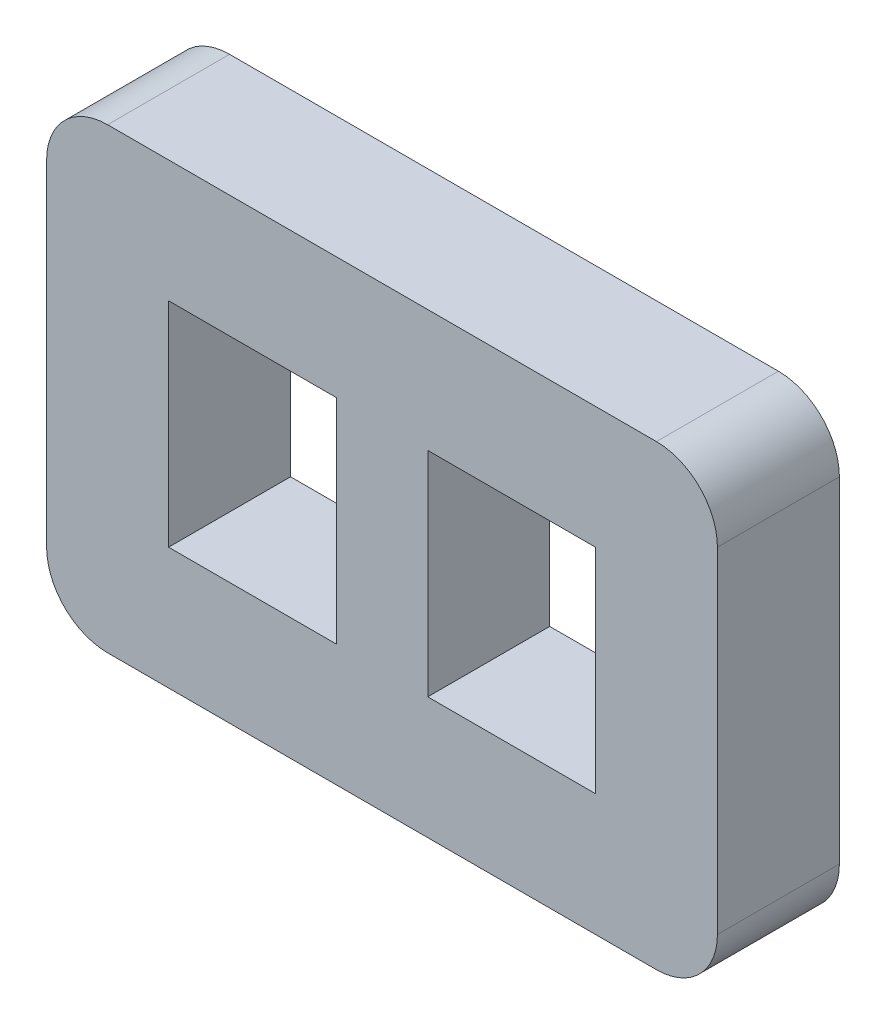
ISO-10303-21;
HEADER;
FILE_DESCRIPTION(('STEP AP214'),'2;1');
FILE_NAME('part.step','',(''),(''),'','','');
FILE_SCHEMA(('AUTOMOTIVE_DESIGN { 1 0 10303 214 1 1 1 1 }'));
ENDSEC;
DATA;
#1=APPLICATION_CONTEXT('core data for automotive mechanical design processes');
#2=APPLICATION_PROTOCOL_DEFINITION('international standard','automotive_design',2000,#1);
#3=PRODUCT_CONTEXT('',#1,'mechanical');
#4=PRODUCT('Part','Part','',(#3));
#5=PRODUCT_RELATED_PRODUCT_CATEGORY('part','',(#4));
#6=PRODUCT_DEFINITION_FORMATION('','',#4);
#7=PRODUCT_DEFINITION_CONTEXT('part definition',#1,'design');
#8=PRODUCT_DEFINITION('design','',#6,#7);
#9=PRODUCT_DEFINITION_SHAPE('','',#8);
#10=(LENGTH_UNIT() NAMED_UNIT(*) SI_UNIT(.MILLI.,.METRE.));
#11=(NAMED_UNIT(*) PLANE_ANGLE_UNIT() SI_UNIT($,.RADIAN.));
#12=(NAMED_UNIT(*) SI_UNIT($,.STERADIAN.) SOLID_ANGLE_UNIT());
#13=UNCERTAINTY_MEASURE_WITH_UNIT(LENGTH_MEASURE(1.E-05),#10,'distance_accuracy_value','');
#14=(GEOMETRIC_REPRESENTATION_CONTEXT(3) GLOBAL_UNCERTAINTY_ASSIGNED_CONTEXT((#13)) GLOBAL_UNIT_ASSIGNED_CONTEXT((#10,
#11,#12)) REPRESENTATION_CONTEXT('',''));
#15=CARTESIAN_POINT('',(0.,0.,0.));
#16=DIRECTION('',(0.,0.,1.));
#17=DIRECTION('',(1.,0.,0.));
#18=AXIS2_PLACEMENT_3D('',#15,#16,#17);
#19=CARTESIAN_POINT('',(-4.5,15.,2.));
#20=DIRECTION('',(0.,0.,1.));
#21=DIRECTION('',(1.,0.,0.));
#22=AXIS2_PLACEMENT_3D('',#19,#20,#21);
#23=PLANE('',#22);
#24=DIRECTION('',(0.,-1.,0.));
#25=VECTOR('',#24,1.);
#26=CARTESIAN_POINT('',(-3.5,16.,2.));
#27=LINE('',#26,#25);
#28=CARTESIAN_POINT('',(-3.5,19.5,2.));
#29=VERTEX_POINT('',#28);
#30=CARTESIAN_POINT('',(-3.5,16.,2.));
#31=VERTEX_POINT('',#30);
#32=EDGE_CURVE('E184',#29,#31,#27,.T.);
#33=ORIENTED_EDGE('',*,*,#32,.F.);
#34=DIRECTION('',(-1.,0.,0.));
#35=VECTOR('',#34,1.);
#36=CARTESIAN_POINT('',(-0.75,19.5,2.));
#37=LINE('',#36,#35);
#38=CARTESIAN_POINT('',(-0.75,19.5,2.));
#39=VERTEX_POINT('',#38);
#40=EDGE_CURVE('E182',#39,#29,#37,.T.);
#41=ORIENTED_EDGE('',*,*,#40,.F.);
#42=DIRECTION('',(0.,1.,0.));
#43=VECTOR('',#42,1.);
#44=CARTESIAN_POINT('',(-0.75,16.,2.));
#45=LINE('',#44,#43);
#46=CARTESIAN_POINT('',(-0.75,16.,2.));
#47=VERTEX_POINT('',#46);
#48=EDGE_CURVE('E190',#47,#39,#45,.T.);
#49=ORIENTED_EDGE('',*,*,#48,.F.);
#50=DIRECTION('',(1.,0.,0.));
#51=VECTOR('',#50,1.);
#52=CARTESIAN_POINT('',(-0.75,16.,2.));
#53=LINE('',#52,#51);
#54=EDGE_CURVE('E187',#31,#47,#53,.T.);
#55=ORIENTED_EDGE('',*,*,#54,.F.);
#56=EDGE_LOOP('',(#33,#41,#49,#55));
#57=FACE_BOUND('',#56,.T.);
#58=CARTESIAN_POINT('',(-4.5,15.,2.));
#59=DIRECTION('',(0.,0.,1.));
#60=DIRECTION('',(1.,0.,0.));
#61=AXIS2_PLACEMENT_3D('',#58,#59,#60);
#62=CIRCLE('',#61,1.);
#63=CARTESIAN_POINT('',(-5.5,15.,2.));
#64=VERTEX_POINT('',#63);
#65=CARTESIAN_POINT('',(-4.49999999999999,14.,2.));
#66=VERTEX_POINT('',#65);
#67=EDGE_CURVE('E213',#64,#66,#62,.T.);
#68=ORIENTED_EDGE('',*,*,#67,.T.);
#69=DIRECTION('',(1.,0.,0.));
#70=VECTOR('',#69,1.);
#71=CARTESIAN_POINT('',(4.49999999999999,14.,2.));
#72=LINE('',#71,#70);
#73=CARTESIAN_POINT('',(4.49999999999999,14.,2.));
#74=VERTEX_POINT('',#73);
#75=EDGE_CURVE('E216',#66,#74,#72,.T.);
#76=ORIENTED_EDGE('',*,*,#75,.T.);
#77=CARTESIAN_POINT('',(4.5,15.,2.));
#78=DIRECTION('',(0.,0.,1.));
#79=DIRECTION('',(1.,0.,0.));
#80=AXIS2_PLACEMENT_3D('',#77,#78,#79);
#81=CIRCLE('',#80,1.);
#82=CARTESIAN_POINT('',(5.5,15.,2.));
#83=VERTEX_POINT('',#82);
#84=EDGE_CURVE('E219',#74,#83,#81,.T.);
#85=ORIENTED_EDGE('',*,*,#84,.T.);
#86=DIRECTION('',(0.,1.,0.));
#87=VECTOR('',#86,1.);
#88=CARTESIAN_POINT('',(5.5,15.,2.));
#89=LINE('',#88,#87);
#90=CARTESIAN_POINT('',(5.5,20.5,2.));
#91=VERTEX_POINT('',#90);
#92=EDGE_CURVE('E221',#83,#91,#89,.T.);
#93=ORIENTED_EDGE('',*,*,#92,.T.);
#94=CARTESIAN_POINT('',(4.5,20.5,2.));
#95=DIRECTION('',(0.,0.,1.));
#96=DIRECTION('',(1.,0.,0.));
#97=AXIS2_PLACEMENT_3D('',#94,#95,#96);
#98=CIRCLE('',#97,1.);
#99=CARTESIAN_POINT('',(4.49999999999999,21.5,2.));
#100=VERTEX_POINT('',#99);
#101=EDGE_CURVE('E223',#91,#100,#98,.T.);
#102=ORIENTED_EDGE('',*,*,#101,.T.);
#103=DIRECTION('',(-1.,0.,0.));
#104=VECTOR('',#103,1.);
#105=CARTESIAN_POINT('',(4.49999999999999,21.5,2.));
#106=LINE('',#105,#104);
#107=CARTESIAN_POINT('',(-4.49999999999999,21.5,2.));
#108=VERTEX_POINT('',#107);
#109=EDGE_CURVE('E225',#100,#108,#106,.T.);
#110=ORIENTED_EDGE('',*,*,#109,.T.);
#111=CARTESIAN_POINT('',(-4.5,20.5,2.));
#112=DIRECTION('',(0.,0.,1.));
#113=DIRECTION('',(-1.,0.,0.));
#114=AXIS2_PLACEMENT_3D('',#111,#112,#113);
#115=CIRCLE('',#114,1.);
#116=CARTESIAN_POINT('',(-5.5,20.5,2.));
#117=VERTEX_POINT('',#116);
#118=EDGE_CURVE('E227',#108,#117,#115,.T.);
#119=ORIENTED_EDGE('',*,*,#118,.T.);
#120=DIRECTION('',(0.,-1.,0.));
#121=VECTOR('',#120,1.);
#122=CARTESIAN_POINT('',(-5.5,15.,2.));
#123=LINE('',#122,#121);
#124=EDGE_CURVE('E229',#117,#64,#123,.T.);
#125=ORIENTED_EDGE('',*,*,#124,.T.);
#126=EDGE_LOOP('',(#68,#76,#85,#93,#102,#110,#119,#125));
#127=FACE_BOUND('',#126,.T.);
#128=DIRECTION('',(-1.,0.,0.));
#129=VECTOR('',#128,1.);
#130=CARTESIAN_POINT('',(3.5,19.5,2.));
#131=LINE('',#130,#129);
#132=CARTESIAN_POINT('',(3.5,19.5,2.));
#133=VERTEX_POINT('',#132);
#134=CARTESIAN_POINT('',(0.75,19.5,2.));
#135=VERTEX_POINT('',#134);
#136=EDGE_CURVE('E154',#133,#135,#131,.T.);
#137=ORIENTED_EDGE('',*,*,#136,.F.);
#138=DIRECTION('',(0.,1.,0.));
#139=VECTOR('',#138,1.);
#140=CARTESIAN_POINT('',(3.5,16.,2.));
#141=LINE('',#140,#139);
#142=CARTESIAN_POINT('',(3.5,16.,2.));
#143=VERTEX_POINT('',#142);
#144=EDGE_CURVE('E146',#143,#133,#141,.T.);
#145=ORIENTED_EDGE('',*,*,#144,.F.);
#146=DIRECTION('',(1.,0.,0.));
#147=VECTOR('',#146,1.);
#148=CARTESIAN_POINT('',(3.5,16.,2.));
#149=LINE('',#148,#147);
#150=CARTESIAN_POINT('',(0.75,16.,2.));
#151=VERTEX_POINT('',#150);
#152=EDGE_CURVE('E168',#151,#143,#149,.T.);
#153=ORIENTED_EDGE('',*,*,#152,.F.);
#154=DIRECTION('',(0.,-1.,0.));
#155=VECTOR('',#154,1.);
#156=CARTESIAN_POINT('',(0.75,16.,2.));
#157=LINE('',#156,#155);
#158=EDGE_CURVE('E166',#135,#151,#157,.T.);
#159=ORIENTED_EDGE('',*,*,#158,.F.);
#160=EDGE_LOOP('',(#137,#145,#153,#159));
#161=FACE_BOUND('',#160,.T.);
#162=ADVANCED_FACE('F33',(#57,#127,#161),#23,.T.);
#163=CARTESIAN_POINT('',(-4.5,15.,0.));
#164=DIRECTION('',(0.,0.,1.));
#165=DIRECTION('',(1.,0.,0.));
#166=AXIS2_PLACEMENT_3D('',#163,#164,#165);
#167=PLANE('',#166);
#168=DIRECTION('',(-1.,0.,0.));
#169=VECTOR('',#168,1.);
#170=CARTESIAN_POINT('',(-0.75,19.5,0.));
#171=LINE('',#170,#169);
#172=CARTESIAN_POINT('',(-0.75,19.5,0.));
#173=VERTEX_POINT('',#172);
#174=CARTESIAN_POINT('',(-3.5,19.5,0.));
#175=VERTEX_POINT('',#174);
#176=EDGE_CURVE('E162',#173,#175,#171,.T.);
#177=ORIENTED_EDGE('',*,*,#176,.T.);
#178=DIRECTION('',(0.,-1.,0.));
#179=VECTOR('',#178,1.);
#180=CARTESIAN_POINT('',(-3.5,16.,0.));
#181=LINE('',#180,#179);
#182=CARTESIAN_POINT('',(-3.5,16.,0.));
#183=VERTEX_POINT('',#182);
#184=EDGE_CURVE('E195',#175,#183,#181,.T.);
#185=ORIENTED_EDGE('',*,*,#184,.T.);
#186=DIRECTION('',(1.,0.,0.));
#187=VECTOR('',#186,1.);
#188=CARTESIAN_POINT('',(-0.75,16.,0.));
#189=LINE('',#188,#187);
#190=CARTESIAN_POINT('',(-0.75,16.,0.));
#191=VERTEX_POINT('',#190);
#192=EDGE_CURVE('E198',#183,#191,#189,.T.);
#193=ORIENTED_EDGE('',*,*,#192,.T.);
#194=DIRECTION('',(0.,1.,0.));
#195=VECTOR('',#194,1.);
#196=CARTESIAN_POINT('',(-0.75,16.,0.));
#197=LINE('',#196,#195);
#198=EDGE_CURVE('E185',#191,#173,#197,.T.);
#199=ORIENTED_EDGE('',*,*,#198,.T.);
#200=EDGE_LOOP('',(#177,#185,#193,#199));
#201=FACE_BOUND('',#200,.T.);
#202=CARTESIAN_POINT('',(-4.5,15.,0.));
#203=DIRECTION('',(0.,0.,1.));
#204=DIRECTION('',(1.,0.,0.));
#205=AXIS2_PLACEMENT_3D('',#202,#203,#204);
#206=CIRCLE('',#205,1.);
#207=CARTESIAN_POINT('',(-5.5,15.,0.));
#208=VERTEX_POINT('',#207);
#209=CARTESIAN_POINT('',(-4.49999999999999,14.,0.));
#210=VERTEX_POINT('',#209);
#211=EDGE_CURVE('E212',#208,#210,#206,.T.);
#212=ORIENTED_EDGE('',*,*,#211,.F.);
#213=DIRECTION('',(0.,-1.,0.));
#214=VECTOR('',#213,1.);
#215=CARTESIAN_POINT('',(-5.5,15.,0.));
#216=LINE('',#215,#214);
#217=CARTESIAN_POINT('',(-5.5,20.5,0.));
#218=VERTEX_POINT('',#217);
#219=EDGE_CURVE('E217',#218,#208,#216,.T.);
#220=ORIENTED_EDGE('',*,*,#219,.F.);
#221=CARTESIAN_POINT('',(-4.5,20.5,0.));
#222=DIRECTION('',(0.,0.,1.));
#223=DIRECTION('',(-1.,0.,0.));
#224=AXIS2_PLACEMENT_3D('',#221,#222,#223);
#225=CIRCLE('',#224,1.);
#226=CARTESIAN_POINT('',(-4.49999999999999,21.5,0.));
#227=VERTEX_POINT('',#226);
#228=EDGE_CURVE('E244',#227,#218,#225,.T.);
#229=ORIENTED_EDGE('',*,*,#228,.F.);
#230=DIRECTION('',(-1.,0.,0.));
#231=VECTOR('',#230,1.);
#232=CARTESIAN_POINT('',(4.49999999999999,21.5,0.));
#233=LINE('',#232,#231);
#234=CARTESIAN_POINT('',(4.49999999999999,21.5,0.));
#235=VERTEX_POINT('',#234);
#236=EDGE_CURVE('E242',#235,#227,#233,.T.);
#237=ORIENTED_EDGE('',*,*,#236,.F.);
#238=CARTESIAN_POINT('',(4.5,20.5,0.));
#239=DIRECTION('',(0.,0.,1.));
#240=DIRECTION('',(1.,0.,0.));
#241=AXIS2_PLACEMENT_3D('',#238,#239,#240);
#242=CIRCLE('',#241,1.);
#243=CARTESIAN_POINT('',(5.5,20.5,0.));
#244=VERTEX_POINT('',#243);
#245=EDGE_CURVE('E240',#244,#235,#242,.T.);
#246=ORIENTED_EDGE('',*,*,#245,.F.);
#247=DIRECTION('',(0.,1.,0.));
#248=VECTOR('',#247,1.);
#249=CARTESIAN_POINT('',(5.5,15.,0.));
#250=LINE('',#249,#248);
#251=CARTESIAN_POINT('',(5.5,15.,0.));
#252=VERTEX_POINT('',#251);
#253=EDGE_CURVE('E238',#252,#244,#250,.T.);
#254=ORIENTED_EDGE('',*,*,#253,.F.);
#255=CARTESIAN_POINT('',(4.5,15.,0.));
#256=DIRECTION('',(0.,0.,1.));
#257=DIRECTION('',(1.,0.,0.));
#258=AXIS2_PLACEMENT_3D('',#255,#256,#257);
#259=CIRCLE('',#258,1.);
#260=CARTESIAN_POINT('',(4.49999999999999,14.,0.));
#261=VERTEX_POINT('',#260);
#262=EDGE_CURVE('E236',#261,#252,#259,.T.);
#263=ORIENTED_EDGE('',*,*,#262,.F.);
#264=DIRECTION('',(1.,0.,0.));
#265=VECTOR('',#264,1.);
#266=CARTESIAN_POINT('',(4.49999999999999,14.,0.));
#267=LINE('',#266,#265);
#268=EDGE_CURVE('E234',#210,#261,#267,.T.);
#269=ORIENTED_EDGE('',*,*,#268,.F.);
#270=EDGE_LOOP('',(#212,#220,#229,#237,#246,#254,#263,#269));
#271=FACE_BOUND('',#270,.T.);
#272=DIRECTION('',(0.,1.,0.));
#273=VECTOR('',#272,1.);
#274=CARTESIAN_POINT('',(3.5,16.,0.));
#275=LINE('',#274,#273);
#276=CARTESIAN_POINT('',(3.5,16.,0.));
#277=VERTEX_POINT('',#276);
#278=CARTESIAN_POINT('',(3.5,19.5,0.));
#279=VERTEX_POINT('',#278);
#280=EDGE_CURVE('E56',#277,#279,#275,.T.);
#281=ORIENTED_EDGE('',*,*,#280,.T.);
#282=DIRECTION('',(-1.,0.,0.));
#283=VECTOR('',#282,1.);
#284=CARTESIAN_POINT('',(3.5,19.5,0.));
#285=LINE('',#284,#283);
#286=CARTESIAN_POINT('',(0.75,19.5,0.));
#287=VERTEX_POINT('',#286);
#288=EDGE_CURVE('E161',#279,#287,#285,.T.);
#289=ORIENTED_EDGE('',*,*,#288,.T.);
#290=DIRECTION('',(0.,-1.,0.));
#291=VECTOR('',#290,1.);
#292=CARTESIAN_POINT('',(0.75,16.,0.));
#293=LINE('',#292,#291);
#294=CARTESIAN_POINT('',(0.75,16.,0.));
#295=VERTEX_POINT('',#294);
#296=EDGE_CURVE('E174',#287,#295,#293,.T.);
#297=ORIENTED_EDGE('',*,*,#296,.T.);
#298=DIRECTION('',(1.,0.,0.));
#299=VECTOR('',#298,1.);
#300=CARTESIAN_POINT('',(3.5,16.,0.));
#301=LINE('',#300,#299);
#302=EDGE_CURVE('E155',#295,#277,#301,.T.);
#303=ORIENTED_EDGE('',*,*,#302,.T.);
#304=EDGE_LOOP('',(#281,#289,#297,#303));
#305=FACE_BOUND('',#304,.T.);
#306=ADVANCED_FACE('F274',(#201,#271,#305),#167,.F.);
#307=CARTESIAN_POINT('',(-4.5,15.,2.));
#308=DIRECTION('',(0.,0.,-1.));
#309=DIRECTION('',(-1.,0.,0.));
#310=AXIS2_PLACEMENT_3D('',#307,#308,#309);
#311=CYLINDRICAL_SURFACE('',#310,1.);
#312=ORIENTED_EDGE('',*,*,#211,.T.);
#313=DIRECTION('',(0.,0.,-1.));
#314=VECTOR('',#313,1.);
#315=CARTESIAN_POINT('',(-4.49999999999999,14.,2.));
#316=LINE('',#315,#314);
#317=EDGE_CURVE('E11',#66,#210,#316,.T.);
#318=ORIENTED_EDGE('',*,*,#317,.F.);
#319=ORIENTED_EDGE('',*,*,#67,.F.);
#320=DIRECTION('',(0.,0.,-1.));
#321=VECTOR('',#320,1.);
#322=CARTESIAN_POINT('',(-5.5,15.,2.));
#323=LINE('',#322,#321);
#324=EDGE_CURVE('E231',#64,#208,#323,.T.);
#325=ORIENTED_EDGE('',*,*,#324,.T.);
#326=EDGE_LOOP('',(#312,#318,#319,#325));
#327=FACE_BOUND('',#326,.T.);
#328=ADVANCED_FACE('F35',(#327),#311,.T.);
#329=CARTESIAN_POINT('',(4.49999999999999,14.,2.));
#330=DIRECTION('',(0.,1.,0.));
#331=DIRECTION('',(-1.,0.,0.));
#332=AXIS2_PLACEMENT_3D('',#329,#330,#331);
#333=PLANE('',#332);
#334=ORIENTED_EDGE('',*,*,#268,.T.);
#335=DIRECTION('',(0.,0.,-1.));
#336=VECTOR('',#335,1.);
#337=CARTESIAN_POINT('',(4.49999999999999,14.,2.));
#338=LINE('',#337,#336);
#339=EDGE_CURVE('E41',#74,#261,#338,.T.);
#340=ORIENTED_EDGE('',*,*,#339,.F.);
#341=ORIENTED_EDGE('',*,*,#75,.F.);
#342=ORIENTED_EDGE('',*,*,#317,.T.);
#343=EDGE_LOOP('',(#334,#340,#341,#342));
#344=FACE_BOUND('',#343,.T.);
#345=ADVANCED_FACE('F291',(#344),#333,.F.);
#346=CARTESIAN_POINT('',(4.5,15.,2.));
#347=DIRECTION('',(0.,0.,-1.));
#348=DIRECTION('',(-1.,0.,0.));
#349=AXIS2_PLACEMENT_3D('',#346,#347,#348);
#350=CYLINDRICAL_SURFACE('',#349,1.);
#351=ORIENTED_EDGE('',*,*,#262,.T.);
#352=DIRECTION('',(0.,0.,-1.));
#353=VECTOR('',#352,1.);
#354=CARTESIAN_POINT('',(5.5,15.,2.));
#355=LINE('',#354,#353);
#356=EDGE_CURVE('E261',#83,#252,#355,.T.);
#357=ORIENTED_EDGE('',*,*,#356,.F.);
#358=ORIENTED_EDGE('',*,*,#84,.F.);
#359=ORIENTED_EDGE('',*,*,#339,.T.);
#360=EDGE_LOOP('',(#351,#357,#358,#359));
#361=FACE_BOUND('',#360,.T.);
#362=ADVANCED_FACE('F268',(#361),#350,.T.);
#363=CARTESIAN_POINT('',(5.5,15.,2.));
#364=DIRECTION('',(-1.,0.,0.));
#365=DIRECTION('',(0.,0.,1.));
#366=AXIS2_PLACEMENT_3D('',#363,#364,#365);
#367=PLANE('',#366);
#368=ORIENTED_EDGE('',*,*,#253,.T.);
#369=DIRECTION('',(0.,0.,-1.));
#370=VECTOR('',#369,1.);
#371=CARTESIAN_POINT('',(5.5,20.5,2.));
#372=LINE('',#371,#370);
#373=EDGE_CURVE('E258',#91,#244,#372,.T.);
#374=ORIENTED_EDGE('',*,*,#373,.F.);
#375=ORIENTED_EDGE('',*,*,#92,.F.);
#376=ORIENTED_EDGE('',*,*,#356,.T.);
#377=EDGE_LOOP('',(#368,#374,#375,#376));
#378=FACE_BOUND('',#377,.T.);
#379=ADVANCED_FACE('F280',(#378),#367,.F.);
#380=CARTESIAN_POINT('',(4.5,20.5,2.));
#381=DIRECTION('',(0.,0.,-1.));
#382=DIRECTION('',(-1.,0.,0.));
#383=AXIS2_PLACEMENT_3D('',#380,#381,#382);
#384=CYLINDRICAL_SURFACE('',#383,1.);
#385=ORIENTED_EDGE('',*,*,#245,.T.);
#386=DIRECTION('',(0.,0.,-1.));
#387=VECTOR('',#386,1.);
#388=CARTESIAN_POINT('',(4.49999999999999,21.5,2.));
#389=LINE('',#388,#387);
#390=EDGE_CURVE('E255',#100,#235,#389,.T.);
#391=ORIENTED_EDGE('',*,*,#390,.F.);
#392=ORIENTED_EDGE('',*,*,#101,.F.);
#393=ORIENTED_EDGE('',*,*,#373,.T.);
#394=EDGE_LOOP('',(#385,#391,#392,#393));
#395=FACE_BOUND('',#394,.T.);
#396=ADVANCED_FACE('F284',(#395),#384,.T.);
#397=CARTESIAN_POINT('',(4.49999999999999,21.5,2.));
#398=DIRECTION('',(0.,-1.,0.));
#399=DIRECTION('',(0.,0.,-1.));
#400=AXIS2_PLACEMENT_3D('',#397,#398,#399);
#401=PLANE('',#400);
#402=ORIENTED_EDGE('',*,*,#236,.T.);
#403=DIRECTION('',(0.,0.,-1.));
#404=VECTOR('',#403,1.);
#405=CARTESIAN_POINT('',(-4.49999999999999,21.5,2.));
#406=LINE('',#405,#404);
#407=EDGE_CURVE('E252',#108,#227,#406,.T.);
#408=ORIENTED_EDGE('',*,*,#407,.F.);
#409=ORIENTED_EDGE('',*,*,#109,.F.);
#410=ORIENTED_EDGE('',*,*,#390,.T.);
#411=EDGE_LOOP('',(#402,#408,#409,#410));
#412=FACE_BOUND('',#411,.T.);
#413=ADVANCED_FACE('F304',(#412),#401,.F.);
#414=CARTESIAN_POINT('',(-4.5,20.5,2.));
#415=DIRECTION('',(0.,0.,-1.));
#416=DIRECTION('',(-1.,0.,0.));
#417=AXIS2_PLACEMENT_3D('',#414,#415,#416);
#418=CYLINDRICAL_SURFACE('',#417,1.);
#419=ORIENTED_EDGE('',*,*,#228,.T.);
#420=DIRECTION('',(0.,0.,-1.));
#421=VECTOR('',#420,1.);
#422=CARTESIAN_POINT('',(-5.5,20.5,2.));
#423=LINE('',#422,#421);
#424=EDGE_CURVE('E249',#117,#218,#423,.T.);
#425=ORIENTED_EDGE('',*,*,#424,.F.);
#426=ORIENTED_EDGE('',*,*,#118,.F.);
#427=ORIENTED_EDGE('',*,*,#407,.T.);
#428=EDGE_LOOP('',(#419,#425,#426,#427));
#429=FACE_BOUND('',#428,.T.);
#430=ADVANCED_FACE('F302',(#429),#418,.T.);
#431=CARTESIAN_POINT('',(-5.5,15.,2.));
#432=DIRECTION('',(1.,0.,0.));
#433=DIRECTION('',(0.,1.,0.));
#434=AXIS2_PLACEMENT_3D('',#431,#432,#433);
#435=PLANE('',#434);
#436=ORIENTED_EDGE('',*,*,#219,.T.);
#437=ORIENTED_EDGE('',*,*,#324,.F.);
#438=ORIENTED_EDGE('',*,*,#124,.F.);
#439=ORIENTED_EDGE('',*,*,#424,.T.);
#440=EDGE_LOOP('',(#436,#437,#438,#439));
#441=FACE_BOUND('',#440,.T.);
#442=ADVANCED_FACE('F297',(#441),#435,.F.);
#443=CARTESIAN_POINT('',(-0.75,19.5,2.));
#444=DIRECTION('',(0.,-1.,0.));
#445=DIRECTION('',(0.,0.,-1.));
#446=AXIS2_PLACEMENT_3D('',#443,#444,#445);
#447=PLANE('',#446);
#448=ORIENTED_EDGE('',*,*,#176,.F.);
#449=DIRECTION('',(0.,0.,-1.));
#450=VECTOR('',#449,1.);
#451=CARTESIAN_POINT('',(-0.75,19.5,2.));
#452=LINE('',#451,#450);
#453=EDGE_CURVE('E192',#39,#173,#452,.T.);
#454=ORIENTED_EDGE('',*,*,#453,.F.);
#455=ORIENTED_EDGE('',*,*,#40,.T.);
#456=DIRECTION('',(0.,0.,-1.));
#457=VECTOR('',#456,1.);
#458=CARTESIAN_POINT('',(-3.5,19.5,2.));
#459=LINE('',#458,#457);
#460=EDGE_CURVE('E209',#29,#175,#459,.T.);
#461=ORIENTED_EDGE('',*,*,#460,.T.);
#462=EDGE_LOOP('',(#448,#454,#455,#461));
#463=FACE_BOUND('',#462,.T.);
#464=ADVANCED_FACE('F323',(#463),#447,.T.);
#465=CARTESIAN_POINT('',(-3.5,16.,2.));
#466=DIRECTION('',(1.,0.,0.));
#467=DIRECTION('',(0.,0.,-1.));
#468=AXIS2_PLACEMENT_3D('',#465,#466,#467);
#469=PLANE('',#468);
#470=ORIENTED_EDGE('',*,*,#184,.F.);
#471=ORIENTED_EDGE('',*,*,#460,.F.);
#472=ORIENTED_EDGE('',*,*,#32,.T.);
#473=DIRECTION('',(0.,0.,-1.));
#474=VECTOR('',#473,1.);
#475=CARTESIAN_POINT('',(-3.5,16.,2.));
#476=LINE('',#475,#474);
#477=EDGE_CURVE('E207',#31,#183,#476,.T.);
#478=ORIENTED_EDGE('',*,*,#477,.T.);
#479=EDGE_LOOP('',(#470,#471,#472,#478));
#480=FACE_BOUND('',#479,.T.);
#481=ADVANCED_FACE('F330',(#480),#469,.T.);
#482=CARTESIAN_POINT('',(-0.75,16.,2.));
#483=DIRECTION('',(0.,1.,0.));
#484=DIRECTION('',(-1.,0.,0.));
#485=AXIS2_PLACEMENT_3D('',#482,#483,#484);
#486=PLANE('',#485);
#487=ORIENTED_EDGE('',*,*,#192,.F.);
#488=ORIENTED_EDGE('',*,*,#477,.F.);
#489=ORIENTED_EDGE('',*,*,#54,.T.);
#490=DIRECTION('',(0.,0.,-1.));
#491=VECTOR('',#490,1.);
#492=CARTESIAN_POINT('',(-0.75,16.,2.));
#493=LINE('',#492,#491);
#494=EDGE_CURVE('E205',#47,#191,#493,.T.);
#495=ORIENTED_EDGE('',*,*,#494,.T.);
#496=EDGE_LOOP('',(#487,#488,#489,#495));
#497=FACE_BOUND('',#496,.T.);
#498=ADVANCED_FACE('F335',(#497),#486,.T.);
#499=CARTESIAN_POINT('',(-0.75,16.,2.));
#500=DIRECTION('',(-1.,0.,0.));
#501=DIRECTION('',(0.,0.,1.));
#502=AXIS2_PLACEMENT_3D('',#499,#500,#501);
#503=PLANE('',#502);
#504=ORIENTED_EDGE('',*,*,#198,.F.);
#505=ORIENTED_EDGE('',*,*,#494,.F.);
#506=ORIENTED_EDGE('',*,*,#48,.T.);
#507=ORIENTED_EDGE('',*,*,#453,.T.);
#508=EDGE_LOOP('',(#504,#505,#506,#507));
#509=FACE_BOUND('',#508,.T.);
#510=ADVANCED_FACE('F342',(#509),#503,.T.);
#511=CARTESIAN_POINT('',(3.5,16.,2.));
#512=DIRECTION('',(-1.,0.,0.));
#513=DIRECTION('',(0.,0.,1.));
#514=AXIS2_PLACEMENT_3D('',#511,#512,#513);
#515=PLANE('',#514);
#516=ORIENTED_EDGE('',*,*,#280,.F.);
#517=DIRECTION('',(0.,0.,-1.));
#518=VECTOR('',#517,1.);
#519=CARTESIAN_POINT('',(3.5,16.,2.));
#520=LINE('',#519,#518);
#521=EDGE_CURVE('E150',#143,#277,#520,.T.);
#522=ORIENTED_EDGE('',*,*,#521,.F.);
#523=ORIENTED_EDGE('',*,*,#144,.T.);
#524=DIRECTION('',(0.,0.,-1.));
#525=VECTOR('',#524,1.);
#526=CARTESIAN_POINT('',(3.5,19.5,2.));
#527=LINE('',#526,#525);
#528=EDGE_CURVE('E149',#133,#279,#527,.T.);
#529=ORIENTED_EDGE('',*,*,#528,.T.);
#530=EDGE_LOOP('',(#516,#522,#523,#529));
#531=FACE_BOUND('',#530,.T.);
#532=ADVANCED_FACE('F148',(#531),#515,.T.);
#533=CARTESIAN_POINT('',(3.5,19.5,2.));
#534=DIRECTION('',(0.,-1.,0.));
#535=DIRECTION('',(0.,0.,-1.));
#536=AXIS2_PLACEMENT_3D('',#533,#534,#535);
#537=PLANE('',#536);
#538=ORIENTED_EDGE('',*,*,#288,.F.);
#539=ORIENTED_EDGE('',*,*,#528,.F.);
#540=ORIENTED_EDGE('',*,*,#136,.T.);
#541=DIRECTION('',(0.,0.,-1.));
#542=VECTOR('',#541,1.);
#543=CARTESIAN_POINT('',(0.75,19.5,2.));
#544=LINE('',#543,#542);
#545=EDGE_CURVE('E163',#135,#287,#544,.T.);
#546=ORIENTED_EDGE('',*,*,#545,.T.);
#547=EDGE_LOOP('',(#538,#539,#540,#546));
#548=FACE_BOUND('',#547,.T.);
#549=ADVANCED_FACE('F158',(#548),#537,.T.);
#550=CARTESIAN_POINT('',(0.75,16.,2.));
#551=DIRECTION('',(1.,0.,0.));
#552=DIRECTION('',(0.,0.,-1.));
#553=AXIS2_PLACEMENT_3D('',#550,#551,#552);
#554=PLANE('',#553);
#555=ORIENTED_EDGE('',*,*,#296,.F.);
#556=ORIENTED_EDGE('',*,*,#545,.F.);
#557=ORIENTED_EDGE('',*,*,#158,.T.);
#558=DIRECTION('',(0.,0.,-1.));
#559=VECTOR('',#558,1.);
#560=CARTESIAN_POINT('',(0.75,16.,2.));
#561=LINE('',#560,#559);
#562=EDGE_CURVE('E48',#151,#295,#561,.T.);
#563=ORIENTED_EDGE('',*,*,#562,.T.);
#564=EDGE_LOOP('',(#555,#556,#557,#563));
#565=FACE_BOUND('',#564,.T.);
#566=ADVANCED_FACE('F359',(#565),#554,.T.);
#567=CARTESIAN_POINT('',(3.5,16.,2.));
#568=DIRECTION('',(0.,1.,0.));
#569=DIRECTION('',(-1.,0.,0.));
#570=AXIS2_PLACEMENT_3D('',#567,#568,#569);
#571=PLANE('',#570);
#572=ORIENTED_EDGE('',*,*,#302,.F.);
#573=ORIENTED_EDGE('',*,*,#562,.F.);
#574=ORIENTED_EDGE('',*,*,#152,.T.);
#575=ORIENTED_EDGE('',*,*,#521,.T.);
#576=EDGE_LOOP('',(#572,#573,#574,#575));
#577=FACE_BOUND('',#576,.T.);
#578=ADVANCED_FACE('F362',(#577),#571,.T.);
#579=CLOSED_SHELL('',(#162,#306,#328,#345,#362,#379,#396,#413,#430,#442,#464,#481,#498,#510,
#532,#549,#566,#578));
#580=MANIFOLD_SOLID_BREP('B2',#579);
#581=ADVANCED_BREP_SHAPE_REPRESENTATION('',(#18,#580),#14);
#582=SHAPE_DEFINITION_REPRESENTATION(#9,#581);
ENDSEC;
END-ISO-10303-21;
